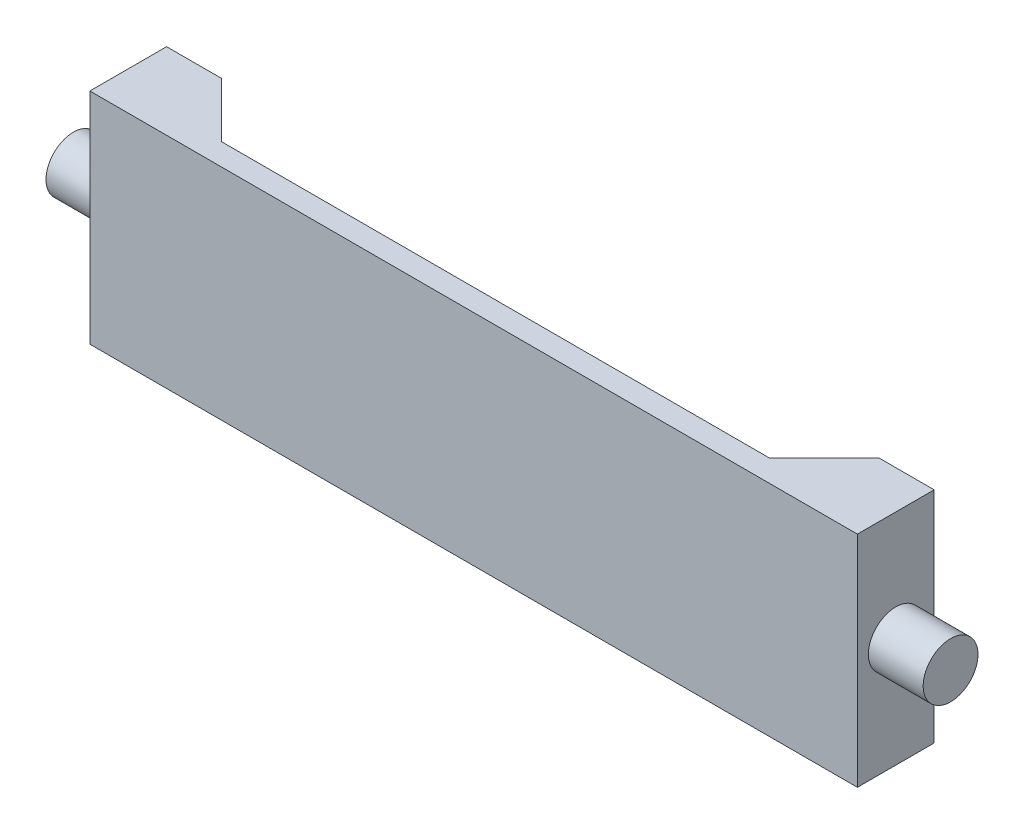
ISO-10303-21;
HEADER;
FILE_DESCRIPTION(('STEP AP214'),'2;1');
FILE_NAME('part.step','',(''),(''),'','','');
FILE_SCHEMA(('AUTOMOTIVE_DESIGN { 1 0 10303 214 1 1 1 1 }'));
ENDSEC;
DATA;
#1=APPLICATION_CONTEXT('core data for automotive mechanical design processes');
#2=APPLICATION_PROTOCOL_DEFINITION('international standard','automotive_design',2000,#1);
#3=PRODUCT_CONTEXT('',#1,'mechanical');
#4=PRODUCT('Part','Part','',(#3));
#5=PRODUCT_RELATED_PRODUCT_CATEGORY('part','',(#4));
#6=PRODUCT_DEFINITION_FORMATION('','',#4);
#7=PRODUCT_DEFINITION_CONTEXT('part definition',#1,'design');
#8=PRODUCT_DEFINITION('design','',#6,#7);
#9=PRODUCT_DEFINITION_SHAPE('','',#8);
#10=(LENGTH_UNIT() NAMED_UNIT(*) SI_UNIT(.MILLI.,.METRE.));
#11=(NAMED_UNIT(*) PLANE_ANGLE_UNIT() SI_UNIT($,.RADIAN.));
#12=(NAMED_UNIT(*) SI_UNIT($,.STERADIAN.) SOLID_ANGLE_UNIT());
#13=UNCERTAINTY_MEASURE_WITH_UNIT(LENGTH_MEASURE(1.E-05),#10,'distance_accuracy_value','');
#14=(GEOMETRIC_REPRESENTATION_CONTEXT(3) GLOBAL_UNCERTAINTY_ASSIGNED_CONTEXT((#13)) GLOBAL_UNIT_ASSIGNED_CONTEXT((#10,
#11,#12)) REPRESENTATION_CONTEXT('',''));
#15=CARTESIAN_POINT('',(0.,0.,0.));
#16=DIRECTION('',(0.,0.,1.));
#17=DIRECTION('',(1.,0.,0.));
#18=AXIS2_PLACEMENT_3D('',#15,#16,#17);
#19=CARTESIAN_POINT('',(0.,0.,0.));
#20=DIRECTION('',(0.,0.,-1.));
#21=DIRECTION('',(-1.,0.,0.));
#22=AXIS2_PLACEMENT_3D('',#19,#20,#21);
#23=PLANE('',#22);
#24=DIRECTION('',(0.,-1.,0.));
#25=VECTOR('',#24,1.);
#26=CARTESIAN_POINT('',(-300.,100.,0.));
#27=LINE('',#26,#25);
#28=CARTESIAN_POINT('',(-300.,100.,0.));
#29=VERTEX_POINT('',#28);
#30=CARTESIAN_POINT('',(-300.,-100.,0.));
#31=VERTEX_POINT('',#30);
#32=EDGE_CURVE('E147',#29,#31,#27,.T.);
#33=ORIENTED_EDGE('',*,*,#32,.T.);
#34=DIRECTION('',(1.,0.,0.));
#35=VECTOR('',#34,1.);
#36=CARTESIAN_POINT('',(-350.,-100.,0.));
#37=LINE('',#36,#35);
#38=CARTESIAN_POINT('',(-350.,-100.,0.));
#39=VERTEX_POINT('',#38);
#40=EDGE_CURVE('E155',#39,#31,#37,.T.);
#41=ORIENTED_EDGE('',*,*,#40,.F.);
#42=DIRECTION('',(0.,-1.,0.));
#43=VECTOR('',#42,1.);
#44=CARTESIAN_POINT('',(-350.,-100.,0.));
#45=LINE('',#44,#43);
#46=CARTESIAN_POINT('',(-350.,100.,0.));
#47=VERTEX_POINT('',#46);
#48=EDGE_CURVE('E165',#47,#39,#45,.T.);
#49=ORIENTED_EDGE('',*,*,#48,.F.);
#50=DIRECTION('',(-1.,0.,0.));
#51=VECTOR('',#50,1.);
#52=CARTESIAN_POINT('',(-350.,100.,0.));
#53=LINE('',#52,#51);
#54=EDGE_CURVE('E163',#29,#47,#53,.T.);
#55=ORIENTED_EDGE('',*,*,#54,.F.);
#56=EDGE_LOOP('',(#33,#41,#49,#55));
#57=FACE_BOUND('',#56,.T.);
#58=ADVANCED_FACE('F41',(#57),#23,.T.);
#59=CARTESIAN_POINT('',(350.,-100.,70.));
#60=DIRECTION('',(-1.,0.,0.));
#61=DIRECTION('',(0.,0.,1.));
#62=AXIS2_PLACEMENT_3D('',#59,#60,#61);
#63=PLANE('',#62);
#64=CARTESIAN_POINT('',(350.,0.,35.));
#65=DIRECTION('',(1.,0.,0.));
#66=DIRECTION('',(0.,0.,-1.));
#67=AXIS2_PLACEMENT_3D('',#64,#65,#66);
#68=CIRCLE('',#67,25.);
#69=CARTESIAN_POINT('',(350.,0.,9.99999999999999));
#70=VERTEX_POINT('',#69);
#71=EDGE_CURVE('E11',#70,#70,#68,.T.);
#72=ORIENTED_EDGE('',*,*,#71,.F.);
#73=EDGE_LOOP('',(#72));
#74=FACE_BOUND('',#73,.T.);
#75=DIRECTION('',(0.,1.,0.));
#76=VECTOR('',#75,1.);
#77=CARTESIAN_POINT('',(350.,-100.,0.));
#78=LINE('',#77,#76);
#79=CARTESIAN_POINT('',(350.,-100.,0.));
#80=VERTEX_POINT('',#79);
#81=CARTESIAN_POINT('',(350.,100.,0.));
#82=VERTEX_POINT('',#81);
#83=EDGE_CURVE('E150',#80,#82,#78,.T.);
#84=ORIENTED_EDGE('',*,*,#83,.T.);
#85=DIRECTION('',(0.,0.,-1.));
#86=VECTOR('',#85,1.);
#87=CARTESIAN_POINT('',(350.,100.,70.));
#88=LINE('',#87,#86);
#89=CARTESIAN_POINT('',(350.,100.,70.));
#90=VERTEX_POINT('',#89);
#91=EDGE_CURVE('E45',#90,#82,#88,.T.);
#92=ORIENTED_EDGE('',*,*,#91,.F.);
#93=DIRECTION('',(0.,1.,0.));
#94=VECTOR('',#93,1.);
#95=CARTESIAN_POINT('',(350.,-100.,70.));
#96=LINE('',#95,#94);
#97=CARTESIAN_POINT('',(350.,-100.,70.));
#98=VERTEX_POINT('',#97);
#99=EDGE_CURVE('E153',#98,#90,#96,.T.);
#100=ORIENTED_EDGE('',*,*,#99,.F.);
#101=DIRECTION('',(0.,0.,-1.));
#102=VECTOR('',#101,1.);
#103=CARTESIAN_POINT('',(350.,-100.,70.));
#104=LINE('',#103,#102);
#105=EDGE_CURVE('E160',#98,#80,#104,.T.);
#106=ORIENTED_EDGE('',*,*,#105,.T.);
#107=EDGE_LOOP('',(#84,#92,#100,#106));
#108=FACE_BOUND('',#107,.T.);
#109=ADVANCED_FACE('F43',(#74,#108),#63,.F.);
#110=CARTESIAN_POINT('',(-350.,100.,70.));
#111=DIRECTION('',(0.,-1.,0.));
#112=DIRECTION('',(0.,0.,-1.));
#113=AXIS2_PLACEMENT_3D('',#110,#111,#112);
#114=PLANE('',#113);
#115=DIRECTION('',(-1.,0.,0.));
#116=VECTOR('',#115,1.);
#117=CARTESIAN_POINT('',(-250.,100.,50.));
#118=LINE('',#117,#116);
#119=CARTESIAN_POINT('',(250.,100.,50.));
#120=VERTEX_POINT('',#119);
#121=CARTESIAN_POINT('',(-250.,100.,50.));
#122=VERTEX_POINT('',#121);
#123=EDGE_CURVE('E127',#120,#122,#118,.T.);
#124=ORIENTED_EDGE('',*,*,#123,.T.);
#125=DIRECTION('',(-0.707106781186547,0.,-0.707106781186548));
#126=VECTOR('',#125,1.);
#127=CARTESIAN_POINT('',(-300.,100.,0.));
#128=LINE('',#127,#126);
#129=EDGE_CURVE('E131',#122,#29,#128,.T.);
#130=ORIENTED_EDGE('',*,*,#129,.T.);
#131=ORIENTED_EDGE('',*,*,#54,.T.);
#132=DIRECTION('',(0.,0.,-1.));
#133=VECTOR('',#132,1.);
#134=CARTESIAN_POINT('',(-350.,100.,70.));
#135=LINE('',#134,#133);
#136=CARTESIAN_POINT('',(-350.,100.,70.));
#137=VERTEX_POINT('',#136);
#138=EDGE_CURVE('E172',#137,#47,#135,.T.);
#139=ORIENTED_EDGE('',*,*,#138,.F.);
#140=DIRECTION('',(-1.,0.,0.));
#141=VECTOR('',#140,1.);
#142=CARTESIAN_POINT('',(-350.,100.,70.));
#143=LINE('',#142,#141);
#144=EDGE_CURVE('E96',#90,#137,#143,.T.);
#145=ORIENTED_EDGE('',*,*,#144,.F.);
#146=ORIENTED_EDGE('',*,*,#91,.T.);
#147=CARTESIAN_POINT('',(300.,100.,0.));
#148=VERTEX_POINT('',#147);
#149=EDGE_CURVE('E135',#82,#148,#53,.T.);
#150=ORIENTED_EDGE('',*,*,#149,.T.);
#151=DIRECTION('',(-0.707106781186547,0.,0.707106781186548));
#152=VECTOR('',#151,1.);
#153=CARTESIAN_POINT('',(250.,100.,50.));
#154=LINE('',#153,#152);
#155=EDGE_CURVE('E58',#148,#120,#154,.T.);
#156=ORIENTED_EDGE('',*,*,#155,.T.);
#157=EDGE_LOOP('',(#124,#130,#131,#139,#145,#146,#150,#156));
#158=FACE_BOUND('',#157,.T.);
#159=ADVANCED_FACE('F134',(#158),#114,.F.);
#160=CARTESIAN_POINT('',(-350.,-100.,70.));
#161=DIRECTION('',(1.,0.,0.));
#162=DIRECTION('',(0.,0.,-1.));
#163=AXIS2_PLACEMENT_3D('',#160,#161,#162);
#164=PLANE('',#163);
#165=CARTESIAN_POINT('',(-350.,0.,35.));
#166=DIRECTION('',(-1.,0.,0.));
#167=DIRECTION('',(0.,0.,1.));
#168=AXIS2_PLACEMENT_3D('',#165,#166,#167);
#169=CIRCLE('',#168,25.);
#170=CARTESIAN_POINT('',(-350.,0.,60.));
#171=VERTEX_POINT('',#170);
#172=EDGE_CURVE('E50',#171,#171,#169,.T.);
#173=ORIENTED_EDGE('',*,*,#172,.F.);
#174=EDGE_LOOP('',(#173));
#175=FACE_BOUND('',#174,.T.);
#176=ORIENTED_EDGE('',*,*,#48,.T.);
#177=DIRECTION('',(0.,0.,-1.));
#178=VECTOR('',#177,1.);
#179=CARTESIAN_POINT('',(-350.,-100.,70.));
#180=LINE('',#179,#178);
#181=CARTESIAN_POINT('',(-350.,-100.,70.));
#182=VERTEX_POINT('',#181);
#183=EDGE_CURVE('E170',#182,#39,#180,.T.);
#184=ORIENTED_EDGE('',*,*,#183,.F.);
#185=DIRECTION('',(0.,-1.,0.));
#186=VECTOR('',#185,1.);
#187=CARTESIAN_POINT('',(-350.,-100.,70.));
#188=LINE('',#187,#186);
#189=EDGE_CURVE('E157',#137,#182,#188,.T.);
#190=ORIENTED_EDGE('',*,*,#189,.F.);
#191=ORIENTED_EDGE('',*,*,#138,.T.);
#192=EDGE_LOOP('',(#176,#184,#190,#191));
#193=FACE_BOUND('',#192,.T.);
#194=ADVANCED_FACE('F183',(#175,#193),#164,.F.);
#195=CARTESIAN_POINT('',(-350.,-100.,70.));
#196=DIRECTION('',(0.,1.,0.));
#197=DIRECTION('',(0.,0.,1.));
#198=AXIS2_PLACEMENT_3D('',#195,#196,#197);
#199=PLANE('',#198);
#200=ORIENTED_EDGE('',*,*,#40,.T.);
#201=DIRECTION('',(-0.707106781186547,0.,-0.707106781186548));
#202=VECTOR('',#201,1.);
#203=CARTESIAN_POINT('',(-300.,-100.,0.));
#204=LINE('',#203,#202);
#205=CARTESIAN_POINT('',(-250.,-100.,50.));
#206=VERTEX_POINT('',#205);
#207=EDGE_CURVE('E136',#206,#31,#204,.T.);
#208=ORIENTED_EDGE('',*,*,#207,.F.);
#209=DIRECTION('',(-1.,0.,0.));
#210=VECTOR('',#209,1.);
#211=CARTESIAN_POINT('',(-250.,-100.,50.));
#212=LINE('',#211,#210);
#213=CARTESIAN_POINT('',(250.,-100.,50.));
#214=VERTEX_POINT('',#213);
#215=EDGE_CURVE('E138',#214,#206,#212,.T.);
#216=ORIENTED_EDGE('',*,*,#215,.F.);
#217=DIRECTION('',(-0.707106781186547,0.,0.707106781186548));
#218=VECTOR('',#217,1.);
#219=CARTESIAN_POINT('',(250.,-100.,50.));
#220=LINE('',#219,#218);
#221=CARTESIAN_POINT('',(300.,-100.,0.));
#222=VERTEX_POINT('',#221);
#223=EDGE_CURVE('E119',#222,#214,#220,.T.);
#224=ORIENTED_EDGE('',*,*,#223,.F.);
#225=EDGE_CURVE('E88',#222,#80,#37,.T.);
#226=ORIENTED_EDGE('',*,*,#225,.T.);
#227=ORIENTED_EDGE('',*,*,#105,.F.);
#228=DIRECTION('',(1.,0.,0.));
#229=VECTOR('',#228,1.);
#230=CARTESIAN_POINT('',(-350.,-100.,70.));
#231=LINE('',#230,#229);
#232=EDGE_CURVE('E67',#182,#98,#231,.T.);
#233=ORIENTED_EDGE('',*,*,#232,.F.);
#234=ORIENTED_EDGE('',*,*,#183,.T.);
#235=EDGE_LOOP('',(#200,#208,#216,#224,#226,#227,#233,#234));
#236=FACE_BOUND('',#235,.T.);
#237=ADVANCED_FACE('F185',(#236),#199,.F.);
#238=CARTESIAN_POINT('',(0.,0.,70.));
#239=DIRECTION('',(0.,0.,-1.));
#240=DIRECTION('',(-1.,0.,0.));
#241=AXIS2_PLACEMENT_3D('',#238,#239,#240);
#242=PLANE('',#241);
#243=ORIENTED_EDGE('',*,*,#99,.T.);
#244=ORIENTED_EDGE('',*,*,#144,.T.);
#245=ORIENTED_EDGE('',*,*,#189,.T.);
#246=ORIENTED_EDGE('',*,*,#232,.T.);
#247=EDGE_LOOP('',(#243,#244,#245,#246));
#248=FACE_BOUND('',#247,.T.);
#249=ADVANCED_FACE('F194',(#248),#242,.F.);
#250=DIRECTION('',(0.,-1.,0.));
#251=VECTOR('',#250,1.);
#252=CARTESIAN_POINT('',(300.,100.,0.));
#253=LINE('',#252,#251);
#254=EDGE_CURVE('E124',#148,#222,#253,.T.);
#255=ORIENTED_EDGE('',*,*,#254,.F.);
#256=ORIENTED_EDGE('',*,*,#149,.F.);
#257=ORIENTED_EDGE('',*,*,#83,.F.);
#258=ORIENTED_EDGE('',*,*,#225,.F.);
#259=EDGE_LOOP('',(#255,#256,#257,#258));
#260=FACE_BOUND('',#259,.T.);
#261=ADVANCED_FACE('F199',(#260),#23,.T.);
#262=CARTESIAN_POINT('',(-300.,100.,0.));
#263=DIRECTION('',(-0.707106781186548,0.,0.707106781186547));
#264=DIRECTION('',(0.707106781186547,0.,0.707106781186548));
#265=AXIS2_PLACEMENT_3D('',#262,#263,#264);
#266=PLANE('',#265);
#267=ORIENTED_EDGE('',*,*,#207,.T.);
#268=ORIENTED_EDGE('',*,*,#32,.F.);
#269=ORIENTED_EDGE('',*,*,#129,.F.);
#270=DIRECTION('',(0.,-1.,0.));
#271=VECTOR('',#270,1.);
#272=CARTESIAN_POINT('',(-250.,100.,50.));
#273=LINE('',#272,#271);
#274=EDGE_CURVE('E123',#122,#206,#273,.T.);
#275=ORIENTED_EDGE('',*,*,#274,.T.);
#276=EDGE_LOOP('',(#267,#268,#269,#275));
#277=FACE_BOUND('',#276,.T.);
#278=ADVANCED_FACE('F193',(#277),#266,.F.);
#279=CARTESIAN_POINT('',(-250.,100.,50.));
#280=DIRECTION('',(0.,0.,1.));
#281=DIRECTION('',(1.,0.,0.));
#282=AXIS2_PLACEMENT_3D('',#279,#280,#281);
#283=PLANE('',#282);
#284=ORIENTED_EDGE('',*,*,#215,.T.);
#285=ORIENTED_EDGE('',*,*,#274,.F.);
#286=ORIENTED_EDGE('',*,*,#123,.F.);
#287=DIRECTION('',(0.,-1.,0.));
#288=VECTOR('',#287,1.);
#289=CARTESIAN_POINT('',(250.,100.,50.));
#290=LINE('',#289,#288);
#291=EDGE_CURVE('E116',#120,#214,#290,.T.);
#292=ORIENTED_EDGE('',*,*,#291,.T.);
#293=EDGE_LOOP('',(#284,#285,#286,#292));
#294=FACE_BOUND('',#293,.T.);
#295=ADVANCED_FACE('F128',(#294),#283,.F.);
#296=CARTESIAN_POINT('',(250.,100.,50.));
#297=DIRECTION('',(0.707106781186548,0.,0.707106781186547));
#298=DIRECTION('',(0.707106781186547,0.,-0.707106781186548));
#299=AXIS2_PLACEMENT_3D('',#296,#297,#298);
#300=PLANE('',#299);
#301=ORIENTED_EDGE('',*,*,#223,.T.);
#302=ORIENTED_EDGE('',*,*,#291,.F.);
#303=ORIENTED_EDGE('',*,*,#155,.F.);
#304=ORIENTED_EDGE('',*,*,#254,.T.);
#305=EDGE_LOOP('',(#301,#302,#303,#304));
#306=FACE_BOUND('',#305,.T.);
#307=ADVANCED_FACE('F118',(#306),#300,.F.);
#308=CARTESIAN_POINT('',(-400.,0.,35.));
#309=DIRECTION('',(1.,0.,0.));
#310=DIRECTION('',(0.,0.,-1.));
#311=AXIS2_PLACEMENT_3D('',#308,#309,#310);
#312=CYLINDRICAL_SURFACE('',#311,25.);
#313=CARTESIAN_POINT('',(-400.,0.,35.));
#314=DIRECTION('',(-1.,0.,0.));
#315=DIRECTION('',(0.,0.,1.));
#316=AXIS2_PLACEMENT_3D('',#313,#314,#315);
#317=CIRCLE('',#316,25.);
#318=CARTESIAN_POINT('',(-400.,0.,60.));
#319=VERTEX_POINT('',#318);
#320=EDGE_CURVE('E145',#319,#319,#317,.T.);
#321=ORIENTED_EDGE('',*,*,#320,.F.);
#322=EDGE_LOOP('',(#321));
#323=FACE_BOUND('',#322,.T.);
#324=ORIENTED_EDGE('',*,*,#172,.T.);
#325=EDGE_LOOP('',(#324));
#326=FACE_BOUND('',#325,.T.);
#327=ADVANCED_FACE('F181',(#323,#326),#312,.T.);
#328=CARTESIAN_POINT('',(-400.,0.,35.));
#329=DIRECTION('',(-1.,0.,0.));
#330=DIRECTION('',(0.,0.,1.));
#331=AXIS2_PLACEMENT_3D('',#328,#329,#330);
#332=PLANE('',#331);
#333=ORIENTED_EDGE('',*,*,#320,.T.);
#334=EDGE_LOOP('',(#333));
#335=FACE_BOUND('',#334,.T.);
#336=ADVANCED_FACE('F224',(#335),#332,.T.);
#337=CARTESIAN_POINT('',(400.,0.,35.));
#338=DIRECTION('',(-1.,0.,0.));
#339=DIRECTION('',(0.,0.,1.));
#340=AXIS2_PLACEMENT_3D('',#337,#338,#339);
#341=CYLINDRICAL_SURFACE('',#340,25.);
#342=CARTESIAN_POINT('',(400.,0.,35.));
#343=DIRECTION('',(1.,0.,0.));
#344=DIRECTION('',(0.,0.,-1.));
#345=AXIS2_PLACEMENT_3D('',#342,#343,#344);
#346=CIRCLE('',#345,25.);
#347=CARTESIAN_POINT('',(400.,0.,9.99999999999999));
#348=VERTEX_POINT('',#347);
#349=EDGE_CURVE('E320',#348,#348,#346,.T.);
#350=ORIENTED_EDGE('',*,*,#349,.F.);
#351=EDGE_LOOP('',(#350));
#352=FACE_BOUND('',#351,.T.);
#353=ORIENTED_EDGE('',*,*,#71,.T.);
#354=EDGE_LOOP('',(#353));
#355=FACE_BOUND('',#354,.T.);
#356=ADVANCED_FACE('F222',(#352,#355),#341,.T.);
#357=CARTESIAN_POINT('',(400.,0.,35.));
#358=DIRECTION('',(1.,0.,0.));
#359=DIRECTION('',(0.,0.,-1.));
#360=AXIS2_PLACEMENT_3D('',#357,#358,#359);
#361=PLANE('',#360);
#362=ORIENTED_EDGE('',*,*,#349,.T.);
#363=EDGE_LOOP('',(#362));
#364=FACE_BOUND('',#363,.T.);
#365=ADVANCED_FACE('F223',(#364),#361,.T.);
#366=CLOSED_SHELL('',(#58,#109,#159,#194,#237,#249,#261,#278,#295,#307,#327,#336,#356,#365));
#367=MANIFOLD_SOLID_BREP('B2',#366);
#368=ADVANCED_BREP_SHAPE_REPRESENTATION('',(#18,#367),#14);
#369=SHAPE_DEFINITION_REPRESENTATION(#9,#368);
ENDSEC;
END-ISO-10303-21;
